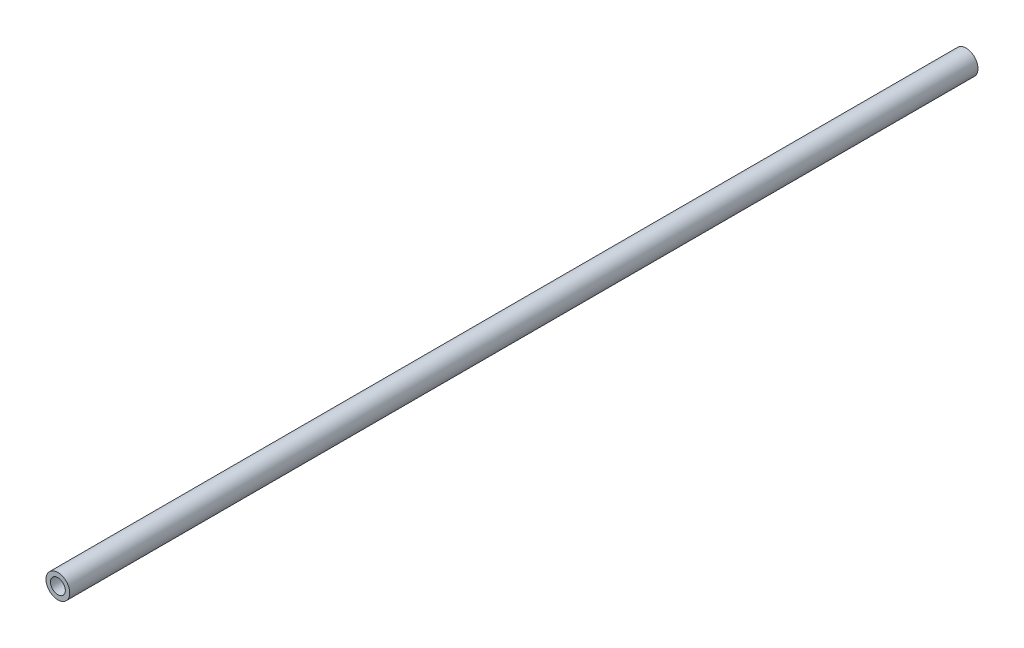
ISO-10303-21;
HEADER;
FILE_DESCRIPTION(('STEP AP214'),'2;1');
FILE_NAME('part.step','',(''),(''),'','','');
FILE_SCHEMA(('AUTOMOTIVE_DESIGN { 1 0 10303 214 1 1 1 1 }'));
ENDSEC;
DATA;
#1=APPLICATION_CONTEXT('core data for automotive mechanical design processes');
#2=APPLICATION_PROTOCOL_DEFINITION('international standard','automotive_design',2000,#1);
#3=PRODUCT_CONTEXT('',#1,'mechanical');
#4=PRODUCT('Part','Part','',(#3));
#5=PRODUCT_RELATED_PRODUCT_CATEGORY('part','',(#4));
#6=PRODUCT_DEFINITION_FORMATION('','',#4);
#7=PRODUCT_DEFINITION_CONTEXT('part definition',#1,'design');
#8=PRODUCT_DEFINITION('design','',#6,#7);
#9=PRODUCT_DEFINITION_SHAPE('','',#8);
#10=(LENGTH_UNIT() NAMED_UNIT(*) SI_UNIT(.MILLI.,.METRE.));
#11=(NAMED_UNIT(*) PLANE_ANGLE_UNIT() SI_UNIT($,.RADIAN.));
#12=(NAMED_UNIT(*) SI_UNIT($,.STERADIAN.) SOLID_ANGLE_UNIT());
#13=UNCERTAINTY_MEASURE_WITH_UNIT(LENGTH_MEASURE(1.E-05),#10,'distance_accuracy_value','');
#14=(GEOMETRIC_REPRESENTATION_CONTEXT(3) GLOBAL_UNCERTAINTY_ASSIGNED_CONTEXT((#13)) GLOBAL_UNIT_ASSIGNED_CONTEXT((#10,
#11,#12)) REPRESENTATION_CONTEXT('',''));
#15=CARTESIAN_POINT('',(0.,0.,0.));
#16=DIRECTION('',(0.,0.,1.));
#17=DIRECTION('',(1.,0.,0.));
#18=AXIS2_PLACEMENT_3D('',#15,#16,#17);
#19=CARTESIAN_POINT('',(0.,0.,-653.17));
#20=DIRECTION('',(0.,0.,1.));
#21=DIRECTION('',(1.,0.,0.));
#22=AXIS2_PLACEMENT_3D('',#19,#20,#21);
#23=CYLINDRICAL_SURFACE('',#22,8.55);
#24=CARTESIAN_POINT('',(0.,0.,-653.17));
#25=DIRECTION('',(0.,0.,1.));
#26=DIRECTION('',(1.,0.,0.));
#27=AXIS2_PLACEMENT_3D('',#24,#25,#26);
#28=CIRCLE('',#27,8.55);
#29=CARTESIAN_POINT('',(8.55,0.,-653.17));
#30=VERTEX_POINT('',#29);
#31=EDGE_CURVE('E10',#30,#30,#28,.T.);
#32=ORIENTED_EDGE('',*,*,#31,.T.);
#33=EDGE_LOOP('',(#32));
#34=FACE_BOUND('',#33,.T.);
#35=CARTESIAN_POINT('',(0.,0.,0.));
#36=DIRECTION('',(0.,0.,1.));
#37=DIRECTION('',(1.,0.,0.));
#38=AXIS2_PLACEMENT_3D('',#35,#36,#37);
#39=CIRCLE('',#38,8.55);
#40=CARTESIAN_POINT('',(8.55,0.,0.));
#41=VERTEX_POINT('',#40);
#42=EDGE_CURVE('E35',#41,#41,#39,.T.);
#43=ORIENTED_EDGE('',*,*,#42,.F.);
#44=EDGE_LOOP('',(#43));
#45=FACE_BOUND('',#44,.T.);
#46=ADVANCED_FACE('F32',(#34,#45),#23,.T.);
#47=CARTESIAN_POINT('',(0.,0.,-653.17));
#48=DIRECTION('',(0.,0.,1.));
#49=DIRECTION('',(1.,0.,0.));
#50=AXIS2_PLACEMENT_3D('',#47,#48,#49);
#51=PLANE('',#50);
#52=CARTESIAN_POINT('',(0.,0.,-653.17));
#53=DIRECTION('',(0.,0.,1.));
#54=DIRECTION('',(1.,0.,0.));
#55=AXIS2_PLACEMENT_3D('',#52,#53,#54);
#56=CIRCLE('',#55,5.35);
#57=CARTESIAN_POINT('',(5.35,0.,-653.17));
#58=VERTEX_POINT('',#57);
#59=EDGE_CURVE('E42',#58,#58,#56,.T.);
#60=ORIENTED_EDGE('',*,*,#59,.T.);
#61=EDGE_LOOP('',(#60));
#62=FACE_BOUND('',#61,.T.);
#63=ORIENTED_EDGE('',*,*,#31,.F.);
#64=EDGE_LOOP('',(#63));
#65=FACE_BOUND('',#64,.T.);
#66=ADVANCED_FACE('F50',(#62,#65),#51,.F.);
#67=CARTESIAN_POINT('',(0.,0.,0.));
#68=DIRECTION('',(0.,0.,1.));
#69=DIRECTION('',(1.,0.,0.));
#70=AXIS2_PLACEMENT_3D('',#67,#68,#69);
#71=PLANE('',#70);
#72=CARTESIAN_POINT('',(0.,0.,0.));
#73=DIRECTION('',(0.,0.,1.));
#74=DIRECTION('',(1.,0.,0.));
#75=AXIS2_PLACEMENT_3D('',#72,#73,#74);
#76=CIRCLE('',#75,5.35);
#77=CARTESIAN_POINT('',(5.35,0.,0.));
#78=VERTEX_POINT('',#77);
#79=EDGE_CURVE('E44',#78,#78,#76,.T.);
#80=ORIENTED_EDGE('',*,*,#79,.F.);
#81=EDGE_LOOP('',(#80));
#82=FACE_BOUND('',#81,.T.);
#83=ORIENTED_EDGE('',*,*,#42,.T.);
#84=EDGE_LOOP('',(#83));
#85=FACE_BOUND('',#84,.T.);
#86=ADVANCED_FACE('F56',(#82,#85),#71,.T.);
#87=CARTESIAN_POINT('',(0.,0.,-653.17));
#88=DIRECTION('',(0.,0.,1.));
#89=DIRECTION('',(1.,0.,0.));
#90=AXIS2_PLACEMENT_3D('',#87,#88,#89);
#91=CYLINDRICAL_SURFACE('',#90,5.35);
#92=ORIENTED_EDGE('',*,*,#59,.F.);
#93=EDGE_LOOP('',(#92));
#94=FACE_BOUND('',#93,.T.);
#95=ORIENTED_EDGE('',*,*,#79,.T.);
#96=EDGE_LOOP('',(#95));
#97=FACE_BOUND('',#96,.T.);
#98=ADVANCED_FACE('F53',(#94,#97),#91,.F.);
#99=CLOSED_SHELL('',(#46,#66,#86,#98));
#100=MANIFOLD_SOLID_BREP('B2',#99);
#101=ADVANCED_BREP_SHAPE_REPRESENTATION('',(#18,#100),#14);
#102=SHAPE_DEFINITION_REPRESENTATION(#9,#101);
ENDSEC;
END-ISO-10303-21;
